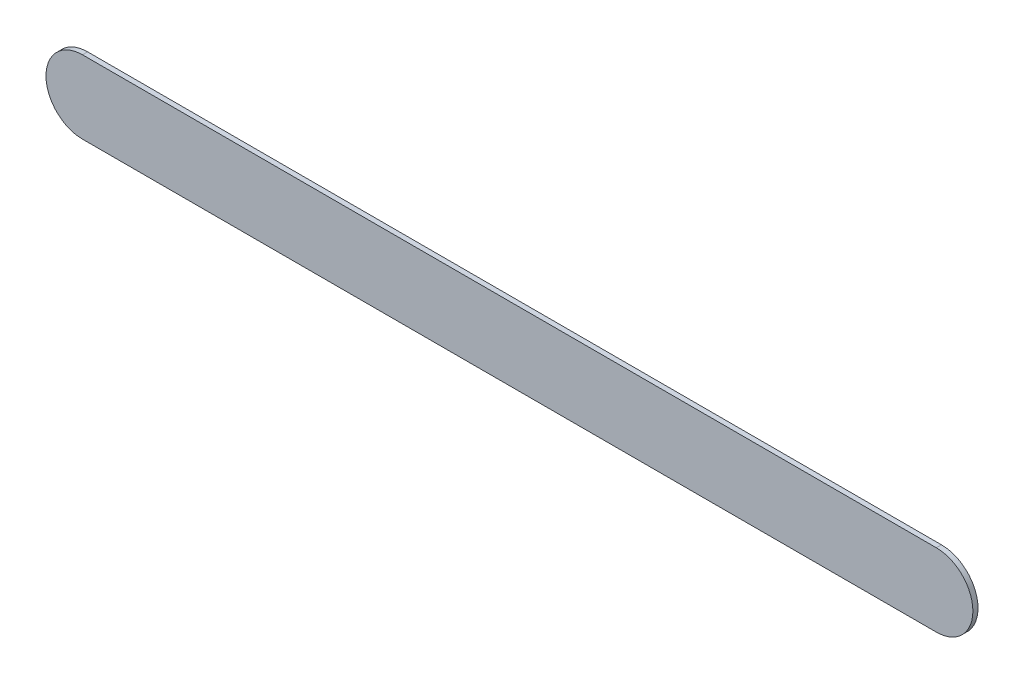
ISO-10303-21;
HEADER;
FILE_DESCRIPTION(('STEP AP214'),'2;1');
FILE_NAME('part.step','',(''),(''),'','','');
FILE_SCHEMA(('AUTOMOTIVE_DESIGN { 1 0 10303 214 1 1 1 1 }'));
ENDSEC;
DATA;
#1=APPLICATION_CONTEXT('core data for automotive mechanical design processes');
#2=APPLICATION_PROTOCOL_DEFINITION('international standard','automotive_design',2000,#1);
#3=PRODUCT_CONTEXT('',#1,'mechanical');
#4=PRODUCT('Part','Part','',(#3));
#5=PRODUCT_RELATED_PRODUCT_CATEGORY('part','',(#4));
#6=PRODUCT_DEFINITION_FORMATION('','',#4);
#7=PRODUCT_DEFINITION_CONTEXT('part definition',#1,'design');
#8=PRODUCT_DEFINITION('design','',#6,#7);
#9=PRODUCT_DEFINITION_SHAPE('','',#8);
#10=(LENGTH_UNIT() NAMED_UNIT(*) SI_UNIT(.MILLI.,.METRE.));
#11=(NAMED_UNIT(*) PLANE_ANGLE_UNIT() SI_UNIT($,.RADIAN.));
#12=(NAMED_UNIT(*) SI_UNIT($,.STERADIAN.) SOLID_ANGLE_UNIT());
#13=UNCERTAINTY_MEASURE_WITH_UNIT(LENGTH_MEASURE(1.E-05),#10,'distance_accuracy_value','');
#14=(GEOMETRIC_REPRESENTATION_CONTEXT(3) GLOBAL_UNCERTAINTY_ASSIGNED_CONTEXT((#13)) GLOBAL_UNIT_ASSIGNED_CONTEXT((#10,
#11,#12)) REPRESENTATION_CONTEXT('',''));
#15=CARTESIAN_POINT('',(0.,0.,0.));
#16=DIRECTION('',(0.,0.,1.));
#17=DIRECTION('',(1.,0.,0.));
#18=AXIS2_PLACEMENT_3D('',#15,#16,#17);
#19=CARTESIAN_POINT('',(133.604,-108.454,0.));
#20=DIRECTION('',(0.,0.,1.));
#21=DIRECTION('',(1.,0.,0.));
#22=AXIS2_PLACEMENT_3D('',#19,#20,#21);
#23=PLANE('',#22);
#24=DIRECTION('',(1.,0.,0.));
#25=VECTOR('',#24,1.);
#26=CARTESIAN_POINT('',(133.604,-108.454,0.));
#27=LINE('',#26,#25);
#28=CARTESIAN_POINT('',(133.604,-108.454,0.));
#29=VERTEX_POINT('',#28);
#30=CARTESIAN_POINT('',(139.446,-108.454,0.));
#31=VERTEX_POINT('',#30);
#32=EDGE_CURVE('E80',#29,#31,#27,.T.);
#33=ORIENTED_EDGE('',*,*,#32,.T.);
#34=CARTESIAN_POINT('',(139.446,-108.204,0.));
#35=DIRECTION('',(0.,0.,1.));
#36=DIRECTION('',(0.,-1.,0.));
#37=AXIS2_PLACEMENT_3D('',#34,#35,#36);
#38=CIRCLE('',#37,0.25);
#39=CARTESIAN_POINT('',(139.446,-107.954,0.));
#40=VERTEX_POINT('',#39);
#41=EDGE_CURVE('E103',#31,#40,#38,.T.);
#42=ORIENTED_EDGE('',*,*,#41,.T.);
#43=DIRECTION('',(-1.,0.,0.));
#44=VECTOR('',#43,1.);
#45=CARTESIAN_POINT('',(139.446,-107.954,0.));
#46=LINE('',#45,#44);
#47=CARTESIAN_POINT('',(133.604,-107.954,0.));
#48=VERTEX_POINT('',#47);
#49=EDGE_CURVE('E73',#40,#48,#46,.T.);
#50=ORIENTED_EDGE('',*,*,#49,.T.);
#51=CARTESIAN_POINT('',(133.604,-108.204,0.));
#52=DIRECTION('',(0.,0.,1.));
#53=DIRECTION('',(0.,1.,0.));
#54=AXIS2_PLACEMENT_3D('',#51,#52,#53);
#55=CIRCLE('',#54,0.25);
#56=EDGE_CURVE('E11',#48,#29,#55,.T.);
#57=ORIENTED_EDGE('',*,*,#56,.T.);
#58=EDGE_LOOP('',(#33,#42,#50,#57));
#59=FACE_BOUND('',#58,.T.);
#60=ADVANCED_FACE('F17',(#59),#23,.T.);
#61=CARTESIAN_POINT('',(133.604,-108.454,-0.035));
#62=DIRECTION('',(0.,0.,1.));
#63=DIRECTION('',(1.,0.,0.));
#64=AXIS2_PLACEMENT_3D('',#61,#62,#63);
#65=PLANE('',#64);
#66=CARTESIAN_POINT('',(133.604,-108.204,-0.035));
#67=DIRECTION('',(0.,0.,1.));
#68=DIRECTION('',(0.,1.,0.));
#69=AXIS2_PLACEMENT_3D('',#66,#67,#68);
#70=CIRCLE('',#69,0.25);
#71=CARTESIAN_POINT('',(133.604,-107.954,-0.035));
#72=VERTEX_POINT('',#71);
#73=CARTESIAN_POINT('',(133.604,-108.454,-0.035));
#74=VERTEX_POINT('',#73);
#75=EDGE_CURVE('E20',#72,#74,#70,.T.);
#76=ORIENTED_EDGE('',*,*,#75,.F.);
#77=DIRECTION('',(-1.,0.,0.));
#78=VECTOR('',#77,1.);
#79=CARTESIAN_POINT('',(139.446,-107.954,-0.035));
#80=LINE('',#79,#78);
#81=CARTESIAN_POINT('',(139.446,-107.954,-0.035));
#82=VERTEX_POINT('',#81);
#83=EDGE_CURVE('E107',#82,#72,#80,.T.);
#84=ORIENTED_EDGE('',*,*,#83,.F.);
#85=CARTESIAN_POINT('',(139.446,-108.204,-0.035));
#86=DIRECTION('',(0.,0.,1.));
#87=DIRECTION('',(0.,-1.,0.));
#88=AXIS2_PLACEMENT_3D('',#85,#86,#87);
#89=CIRCLE('',#88,0.25);
#90=CARTESIAN_POINT('',(139.446,-108.454,-0.035));
#91=VERTEX_POINT('',#90);
#92=EDGE_CURVE('E82',#91,#82,#89,.T.);
#93=ORIENTED_EDGE('',*,*,#92,.F.);
#94=DIRECTION('',(1.,0.,0.));
#95=VECTOR('',#94,1.);
#96=CARTESIAN_POINT('',(133.604,-108.454,-0.035));
#97=LINE('',#96,#95);
#98=EDGE_CURVE('E78',#74,#91,#97,.T.);
#99=ORIENTED_EDGE('',*,*,#98,.F.);
#100=EDGE_LOOP('',(#76,#84,#93,#99));
#101=FACE_BOUND('',#100,.T.);
#102=ADVANCED_FACE('F84',(#101),#65,.F.);
#103=CARTESIAN_POINT('',(133.604,-108.204,-0.035));
#104=DIRECTION('',(0.,0.,-1.));
#105=DIRECTION('',(0.,1.,0.));
#106=AXIS2_PLACEMENT_3D('',#103,#104,#105);
#107=CYLINDRICAL_SURFACE('',#106,0.25);
#108=ORIENTED_EDGE('',*,*,#75,.T.);
#109=DIRECTION('',(0.,0.,1.));
#110=VECTOR('',#109,1.);
#111=CARTESIAN_POINT('',(133.604,-108.454,-0.035));
#112=LINE('',#111,#110);
#113=EDGE_CURVE('E65',#74,#29,#112,.T.);
#114=ORIENTED_EDGE('',*,*,#113,.T.);
#115=ORIENTED_EDGE('',*,*,#56,.F.);
#116=DIRECTION('',(0.,0.,1.));
#117=VECTOR('',#116,1.);
#118=CARTESIAN_POINT('',(133.604,-107.954,-0.035));
#119=LINE('',#118,#117);
#120=EDGE_CURVE('E68',#72,#48,#119,.T.);
#121=ORIENTED_EDGE('',*,*,#120,.F.);
#122=EDGE_LOOP('',(#108,#114,#115,#121));
#123=FACE_BOUND('',#122,.T.);
#124=ADVANCED_FACE('F64',(#123),#107,.T.);
#125=CARTESIAN_POINT('',(139.446,-107.954,-0.035));
#126=DIRECTION('',(0.,-1.,0.));
#127=DIRECTION('',(0.,0.,-1.));
#128=AXIS2_PLACEMENT_3D('',#125,#126,#127);
#129=PLANE('',#128);
#130=ORIENTED_EDGE('',*,*,#83,.T.);
#131=ORIENTED_EDGE('',*,*,#120,.T.);
#132=ORIENTED_EDGE('',*,*,#49,.F.);
#133=DIRECTION('',(0.,0.,1.));
#134=VECTOR('',#133,1.);
#135=CARTESIAN_POINT('',(139.446,-107.954,-0.035));
#136=LINE('',#135,#134);
#137=EDGE_CURVE('E99',#82,#40,#136,.T.);
#138=ORIENTED_EDGE('',*,*,#137,.F.);
#139=EDGE_LOOP('',(#130,#131,#132,#138));
#140=FACE_BOUND('',#139,.T.);
#141=ADVANCED_FACE('F116',(#140),#129,.F.);
#142=CARTESIAN_POINT('',(139.446,-108.204,-0.035));
#143=DIRECTION('',(0.,0.,-1.));
#144=DIRECTION('',(0.,-1.,0.));
#145=AXIS2_PLACEMENT_3D('',#142,#143,#144);
#146=CYLINDRICAL_SURFACE('',#145,0.25);
#147=ORIENTED_EDGE('',*,*,#92,.T.);
#148=ORIENTED_EDGE('',*,*,#137,.T.);
#149=ORIENTED_EDGE('',*,*,#41,.F.);
#150=DIRECTION('',(0.,0.,1.));
#151=VECTOR('',#150,1.);
#152=CARTESIAN_POINT('',(139.446,-108.454,-0.035));
#153=LINE('',#152,#151);
#154=EDGE_CURVE('E88',#91,#31,#153,.T.);
#155=ORIENTED_EDGE('',*,*,#154,.F.);
#156=EDGE_LOOP('',(#147,#148,#149,#155));
#157=FACE_BOUND('',#156,.T.);
#158=ADVANCED_FACE('F119',(#157),#146,.T.);
#159=CARTESIAN_POINT('',(133.604,-108.454,-0.035));
#160=DIRECTION('',(0.,1.,0.));
#161=DIRECTION('',(1.,0.,0.));
#162=AXIS2_PLACEMENT_3D('',#159,#160,#161);
#163=PLANE('',#162);
#164=ORIENTED_EDGE('',*,*,#98,.T.);
#165=ORIENTED_EDGE('',*,*,#154,.T.);
#166=ORIENTED_EDGE('',*,*,#32,.F.);
#167=ORIENTED_EDGE('',*,*,#113,.F.);
#168=EDGE_LOOP('',(#164,#165,#166,#167));
#169=FACE_BOUND('',#168,.T.);
#170=ADVANCED_FACE('F76',(#169),#163,.F.);
#171=CLOSED_SHELL('',(#60,#102,#124,#141,#158,#170));
#172=MANIFOLD_SOLID_BREP('B1',#171);
#173=ADVANCED_BREP_SHAPE_REPRESENTATION('',(#18,#172),#14);
#174=SHAPE_DEFINITION_REPRESENTATION(#9,#173);
ENDSEC;
END-ISO-10303-21;
